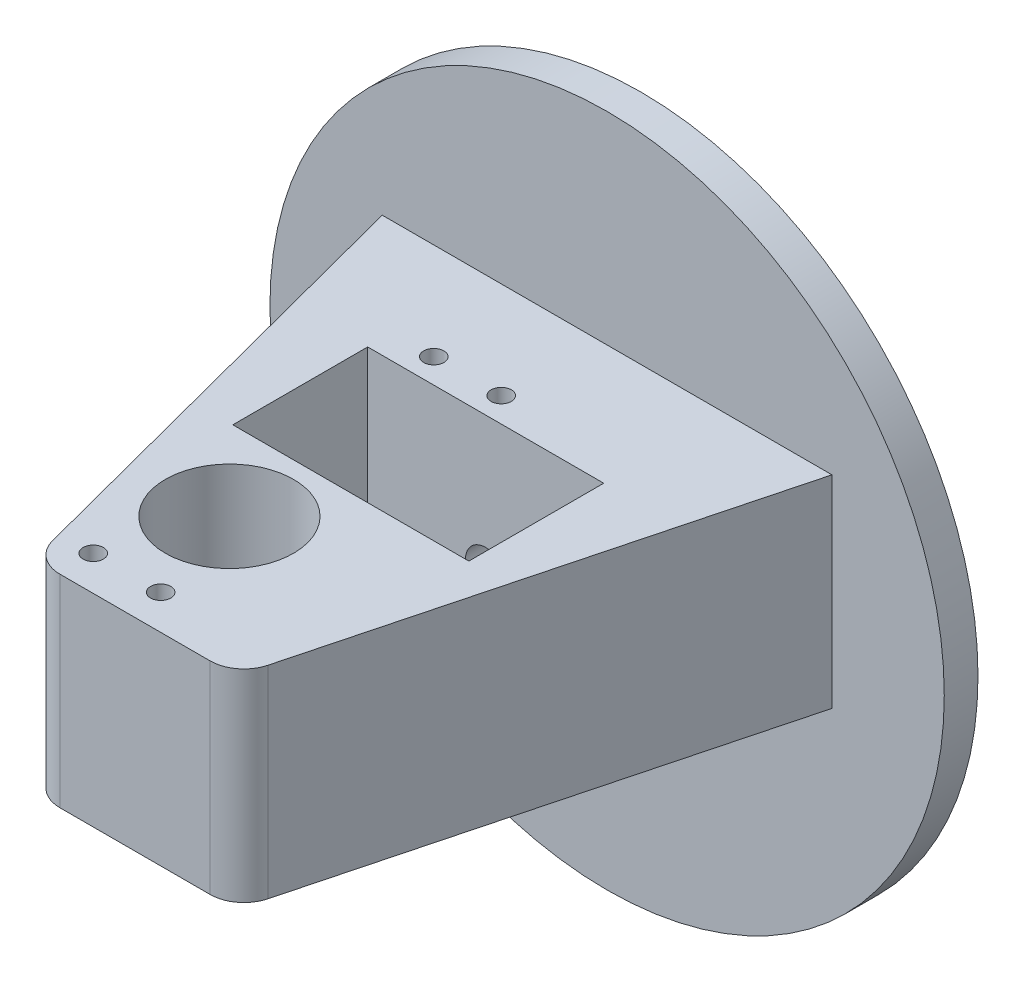
ISO-10303-21;
HEADER;
FILE_DESCRIPTION(('STEP AP214'),'2;1');
FILE_NAME('part.step','',(''),(''),'','','');
FILE_SCHEMA(('AUTOMOTIVE_DESIGN { 1 0 10303 214 1 1 1 1 }'));
ENDSEC;
DATA;
#1=APPLICATION_CONTEXT('core data for automotive mechanical design processes');
#2=APPLICATION_PROTOCOL_DEFINITION('international standard','automotive_design',2000,#1);
#3=PRODUCT_CONTEXT('',#1,'mechanical');
#4=PRODUCT('Part','Part','',(#3));
#5=PRODUCT_RELATED_PRODUCT_CATEGORY('part','',(#4));
#6=PRODUCT_DEFINITION_FORMATION('','',#4);
#7=PRODUCT_DEFINITION_CONTEXT('part definition',#1,'design');
#8=PRODUCT_DEFINITION('design','',#6,#7);
#9=PRODUCT_DEFINITION_SHAPE('','',#8);
#10=(LENGTH_UNIT() NAMED_UNIT(*) SI_UNIT(.MILLI.,.METRE.));
#11=(NAMED_UNIT(*) PLANE_ANGLE_UNIT() SI_UNIT($,.RADIAN.));
#12=(NAMED_UNIT(*) SI_UNIT($,.STERADIAN.) SOLID_ANGLE_UNIT());
#13=UNCERTAINTY_MEASURE_WITH_UNIT(LENGTH_MEASURE(1.E-05),#10,'distance_accuracy_value','');
#14=(GEOMETRIC_REPRESENTATION_CONTEXT(3) GLOBAL_UNCERTAINTY_ASSIGNED_CONTEXT((#13)) GLOBAL_UNIT_ASSIGNED_CONTEXT((#10,
#11,#12)) REPRESENTATION_CONTEXT('',''));
#15=CARTESIAN_POINT('',(0.,0.,0.));
#16=DIRECTION('',(0.,0.,1.));
#17=DIRECTION('',(1.,0.,0.));
#18=AXIS2_PLACEMENT_3D('',#15,#16,#17);
#19=CARTESIAN_POINT('',(-5.99999999999999,-20.000000000025,54.9999999999909));
#20=DIRECTION('',(0.,1.,4.54303261676614E-13));
#21=DIRECTION('',(0.,-4.54303261676614E-13,1.));
#22=AXIS2_PLACEMENT_3D('',#19,#20,#21);
#23=CYLINDRICAL_SURFACE('',#22,5.);
#24=CARTESIAN_POINT('',(-5.99999999999999,-2.49869569479699E-11,55.));
#25=DIRECTION('',(0.,1.,4.54303261676614E-13));
#26=DIRECTION('',(0.,-4.54303261676614E-13,1.));
#27=AXIS2_PLACEMENT_3D('',#24,#25,#26);
#28=CIRCLE('',#27,5.);
#29=CARTESIAN_POINT('',(-5.99999999999999,-2.7258473256353E-11,60.));
#30=VERTEX_POINT('',#29);
#31=EDGE_CURVE('E148',#30,#30,#28,.T.);
#32=ORIENTED_EDGE('',*,*,#31,.T.);
#33=EDGE_LOOP('',(#32));
#34=FACE_BOUND('',#33,.T.);
#35=CARTESIAN_POINT('',(-5.99999999999999,-4.00000000002499,54.9999999999982));
#36=DIRECTION('',(0.,-1.,-4.54303261676614E-13));
#37=DIRECTION('',(0.,4.54303261676614E-13,-1.));
#38=AXIS2_PLACEMENT_3D('',#35,#36,#37);
#39=CIRCLE('',#38,5.);
#40=CARTESIAN_POINT('',(-5.99999999999999,-4.00000000002272,49.9999999999982));
#41=VERTEX_POINT('',#40);
#42=EDGE_CURVE('E146',#41,#41,#39,.F.);
#43=ORIENTED_EDGE('',*,*,#42,.F.);
#44=EDGE_LOOP('',(#43));
#45=FACE_BOUND('',#44,.T.);
#46=ADVANCED_FACE('F38',(#34,#45),#23,.F.);
#47=CARTESIAN_POINT('',(-11.141347684202,-20.0000000000318,69.9999999999909));
#48=DIRECTION('',(0.,1.,4.54303261676614E-13));
#49=DIRECTION('',(0.,-4.54303261676614E-13,1.));
#50=AXIS2_PLACEMENT_3D('',#47,#48,#49);
#51=CYLINDRICAL_SURFACE('',#50,5.);
#52=DIRECTION('',(0.,1.,4.54303261676614E-13));
#53=VECTOR('',#52,1.);
#54=CARTESIAN_POINT('',(-15.978061053794,-20.0000000000324,71.2673609511055));
#55=LINE('',#54,#53);
#56=CARTESIAN_POINT('',(-15.978061053794,-10.0000000000324,71.26736095111));
#57=VERTEX_POINT('',#56);
#58=CARTESIAN_POINT('',(-15.978061053794,19.9999999999676,71.2673609511237));
#59=VERTEX_POINT('',#58);
#60=EDGE_CURVE('E11',#57,#59,#55,.T.);
#61=ORIENTED_EDGE('',*,*,#60,.F.);
#62=CARTESIAN_POINT('',(-11.141347684202,-10.0000000000318,69.9999999999955));
#63=DIRECTION('',(0.,1.,4.54303261676614E-13));
#64=DIRECTION('',(0.,-4.54303261676614E-13,1.));
#65=AXIS2_PLACEMENT_3D('',#62,#63,#64);
#66=CIRCLE('',#65,5.);
#67=CARTESIAN_POINT('',(-11.141347684202,-10.0000000000341,74.9999999999955));
#68=VERTEX_POINT('',#67);
#69=EDGE_CURVE('E122',#57,#68,#66,.T.);
#70=ORIENTED_EDGE('',*,*,#69,.T.);
#71=DIRECTION('',(0.,1.,4.54303261676614E-13));
#72=VECTOR('',#71,1.);
#73=CARTESIAN_POINT('',(-11.141347684202,-20.0000000000341,74.9999999999909));
#74=LINE('',#73,#72);
#75=CARTESIAN_POINT('',(-11.141347684202,19.9999999999659,75.0000000000091));
#76=VERTEX_POINT('',#75);
#77=EDGE_CURVE('E187',#68,#76,#74,.T.);
#78=ORIENTED_EDGE('',*,*,#77,.T.);
#79=CARTESIAN_POINT('',(-11.141347684202,19.9999999999682,70.0000000000091));
#80=DIRECTION('',(0.,-1.,-4.54303261676614E-13));
#81=DIRECTION('',(0.,4.54303261676614E-13,-1.));
#82=AXIS2_PLACEMENT_3D('',#79,#80,#81);
#83=CIRCLE('',#82,5.);
#84=EDGE_CURVE('E170',#76,#59,#83,.T.);
#85=ORIENTED_EDGE('',*,*,#84,.T.);
#86=EDGE_LOOP('',(#61,#70,#78,#85));
#87=FACE_BOUND('',#86,.T.);
#88=ADVANCED_FACE('F40',(#87),#51,.T.);
#89=CARTESIAN_POINT('',(-33.3420558133058,-20.0000000000023,4.99999999999093));
#90=DIRECTION('',(0.9673426739184,1.15153242762584E-13,-0.253472190222911));
#91=DIRECTION('',(0.253472190222911,-4.39466931920107E-13,0.9673426739184));
#92=AXIS2_PLACEMENT_3D('',#89,#90,#91);
#93=PLANE('',#92);
#94=DIRECTION('',(0.,1.,4.54303261676614E-13));
#95=VECTOR('',#94,1.);
#96=CARTESIAN_POINT('',(-33.3420558133058,-20.0000000000023,4.99999999999093));
#97=LINE('',#96,#95);
#98=CARTESIAN_POINT('',(-33.3420558133058,-10.0000000000023,4.99999999999547));
#99=VERTEX_POINT('',#98);
#100=CARTESIAN_POINT('',(-33.3420558133058,19.9999999999977,5.00000000000909));
#101=VERTEX_POINT('',#100);
#102=EDGE_CURVE('E47',#99,#101,#97,.T.);
#103=ORIENTED_EDGE('',*,*,#102,.F.);
#104=DIRECTION('',(0.253472190222911,-4.39466931920107E-13,0.9673426739184));
#105=VECTOR('',#104,1.);
#106=CARTESIAN_POINT('',(-33.3420558133058,-10.0000000000023,4.99999999999547));
#107=LINE('',#106,#105);
#108=EDGE_CURVE('E116',#99,#57,#107,.T.);
#109=ORIENTED_EDGE('',*,*,#108,.T.);
#110=ORIENTED_EDGE('',*,*,#60,.T.);
#111=DIRECTION('',(-0.253472190222911,4.39466931920107E-13,-0.9673426739184));
#112=VECTOR('',#111,1.);
#113=CARTESIAN_POINT('',(-33.3420558133058,19.9999999999977,5.00000000000909));
#114=LINE('',#113,#112);
#115=EDGE_CURVE('E141',#59,#101,#114,.T.);
#116=ORIENTED_EDGE('',*,*,#115,.T.);
#117=EDGE_LOOP('',(#103,#109,#110,#116));
#118=FACE_BOUND('',#117,.T.);
#119=ADVANCED_FACE('F139',(#118),#93,.F.);
#120=CARTESIAN_POINT('',(15.978061053794,-20.0000000000324,71.2673609511055));
#121=DIRECTION('',(-0.9673426739184,1.15153242762584E-13,-0.253472190222912));
#122=DIRECTION('',(0.253472190222911,4.39466931920106E-13,-0.9673426739184));
#123=AXIS2_PLACEMENT_3D('',#120,#121,#122);
#124=PLANE('',#123);
#125=DIRECTION('',(0.,1.,4.54303261676614E-13));
#126=VECTOR('',#125,1.);
#127=CARTESIAN_POINT('',(15.978061053794,-20.0000000000324,71.2673609511055));
#128=LINE('',#127,#126);
#129=CARTESIAN_POINT('',(15.978061053794,-10.0000000000324,71.26736095111));
#130=VERTEX_POINT('',#129);
#131=CARTESIAN_POINT('',(15.978061053794,19.9999999999676,71.2673609511237));
#132=VERTEX_POINT('',#131);
#133=EDGE_CURVE('E143',#130,#132,#128,.T.);
#134=ORIENTED_EDGE('',*,*,#133,.F.);
#135=DIRECTION('',(0.253472190222911,4.39466931920106E-13,-0.9673426739184));
#136=VECTOR('',#135,1.);
#137=CARTESIAN_POINT('',(15.978061053794,-10.0000000000324,71.26736095111));
#138=LINE('',#137,#136);
#139=CARTESIAN_POINT('',(33.3420558133058,-10.0000000000023,4.99999999999547));
#140=VERTEX_POINT('',#139);
#141=EDGE_CURVE('E211',#130,#140,#138,.T.);
#142=ORIENTED_EDGE('',*,*,#141,.T.);
#143=DIRECTION('',(0.,1.,4.54303261676614E-13));
#144=VECTOR('',#143,1.);
#145=CARTESIAN_POINT('',(33.3420558133058,-20.0000000000023,4.99999999999093));
#146=LINE('',#145,#144);
#147=CARTESIAN_POINT('',(33.3420558133058,19.9999999999977,5.00000000000909));
#148=VERTEX_POINT('',#147);
#149=EDGE_CURVE('E134',#140,#148,#146,.T.);
#150=ORIENTED_EDGE('',*,*,#149,.T.);
#151=DIRECTION('',(-0.253472190222911,-4.39466931920106E-13,0.9673426739184));
#152=VECTOR('',#151,1.);
#153=CARTESIAN_POINT('',(15.978061053794,19.9999999999676,71.2673609511237));
#154=LINE('',#153,#152);
#155=EDGE_CURVE('E178',#148,#132,#154,.T.);
#156=ORIENTED_EDGE('',*,*,#155,.T.);
#157=EDGE_LOOP('',(#134,#142,#150,#156));
#158=FACE_BOUND('',#157,.T.);
#159=ADVANCED_FACE('F200',(#158),#124,.F.);
#160=CARTESIAN_POINT('',(11.141347684202,-20.0000000000318,69.9999999999909));
#161=DIRECTION('',(0.,1.,4.54303261676614E-13));
#162=DIRECTION('',(0.,-4.54303261676614E-13,1.));
#163=AXIS2_PLACEMENT_3D('',#160,#161,#162);
#164=CYLINDRICAL_SURFACE('',#163,5.);
#165=DIRECTION('',(0.,1.,4.54303261676614E-13));
#166=VECTOR('',#165,1.);
#167=CARTESIAN_POINT('',(11.141347684202,-20.0000000000341,74.9999999999909));
#168=LINE('',#167,#166);
#169=CARTESIAN_POINT('',(11.141347684202,-10.0000000000341,74.9999999999955));
#170=VERTEX_POINT('',#169);
#171=CARTESIAN_POINT('',(11.141347684202,19.9999999999659,75.0000000000091));
#172=VERTEX_POINT('',#171);
#173=EDGE_CURVE('E189',#170,#172,#168,.T.);
#174=ORIENTED_EDGE('',*,*,#173,.F.);
#175=CARTESIAN_POINT('',(11.141347684202,-10.0000000000318,69.9999999999955));
#176=DIRECTION('',(0.,1.,4.54303261676614E-13));
#177=DIRECTION('',(0.,-4.54303261676614E-13,1.));
#178=AXIS2_PLACEMENT_3D('',#175,#176,#177);
#179=CIRCLE('',#178,5.);
#180=EDGE_CURVE('E197',#170,#130,#179,.T.);
#181=ORIENTED_EDGE('',*,*,#180,.T.);
#182=ORIENTED_EDGE('',*,*,#133,.T.);
#183=CARTESIAN_POINT('',(11.141347684202,19.9999999999682,70.0000000000091));
#184=DIRECTION('',(0.,-1.,-4.54303261676614E-13));
#185=DIRECTION('',(0.,-4.54303261676614E-13,1.));
#186=AXIS2_PLACEMENT_3D('',#183,#184,#185);
#187=CIRCLE('',#186,5.);
#188=EDGE_CURVE('E181',#132,#172,#187,.T.);
#189=ORIENTED_EDGE('',*,*,#188,.T.);
#190=EDGE_LOOP('',(#174,#181,#182,#189));
#191=FACE_BOUND('',#190,.T.);
#192=ADVANCED_FACE('F194',(#191),#164,.T.);
#193=CARTESIAN_POINT('',(-11.141347684202,-20.0000000000341,74.9999999999909));
#194=DIRECTION('',(0.,4.54303261676614E-13,-1.));
#195=DIRECTION('',(1.,0.,0.));
#196=AXIS2_PLACEMENT_3D('',#193,#194,#195);
#197=PLANE('',#196);
#198=ORIENTED_EDGE('',*,*,#77,.F.);
#199=DIRECTION('',(1.,0.,0.));
#200=VECTOR('',#199,1.);
#201=CARTESIAN_POINT('',(-11.141347684202,-10.0000000000341,74.9999999999955));
#202=LINE('',#201,#200);
#203=EDGE_CURVE('E208',#68,#170,#202,.T.);
#204=ORIENTED_EDGE('',*,*,#203,.T.);
#205=ORIENTED_EDGE('',*,*,#173,.T.);
#206=DIRECTION('',(-1.,0.,0.));
#207=VECTOR('',#206,1.);
#208=CARTESIAN_POINT('',(-11.141347684202,19.9999999999659,75.0000000000091));
#209=LINE('',#208,#207);
#210=EDGE_CURVE('E184',#172,#76,#209,.T.);
#211=ORIENTED_EDGE('',*,*,#210,.T.);
#212=EDGE_LOOP('',(#198,#204,#205,#211));
#213=FACE_BOUND('',#212,.T.);
#214=ADVANCED_FACE('F206',(#213),#197,.F.);
#215=CARTESIAN_POINT('',(-11.141347684202,19.9999999999682,70.0000000000091));
#216=DIRECTION('',(0.,-1.,-4.54303261676614E-13));
#217=DIRECTION('',(0.,4.54303261676614E-13,-1.));
#218=AXIS2_PLACEMENT_3D('',#215,#216,#217);
#219=PLANE('',#218);
#220=CARTESIAN_POINT('',(-11.3501899868682,19.9999999999912,19.3500000000087));
#221=DIRECTION('',(0.,1.,4.54303261676614E-13));
#222=DIRECTION('',(0.,-4.54303261676614E-13,1.));
#223=AXIS2_PLACEMENT_3D('',#220,#221,#222);
#224=CIRCLE('',#223,1.50000000000009);
#225=CARTESIAN_POINT('',(-11.3501899868682,19.9999999999905,20.8500000000087));
#226=VERTEX_POINT('',#225);
#227=EDGE_CURVE('E272',#226,#226,#224,.T.);
#228=ORIENTED_EDGE('',*,*,#227,.F.);
#229=EDGE_LOOP('',(#228));
#230=FACE_BOUND('',#229,.T.);
#231=CARTESIAN_POINT('',(-1.35018998686818,19.9999999999912,19.3500000000087));
#232=DIRECTION('',(0.,1.,4.54303261676614E-13));
#233=DIRECTION('',(0.,-4.54303261676614E-13,1.));
#234=AXIS2_PLACEMENT_3D('',#231,#232,#233);
#235=CIRCLE('',#234,1.5000000000001);
#236=CARTESIAN_POINT('',(-1.35018998686818,19.9999999999905,20.8500000000088));
#237=VERTEX_POINT('',#236);
#238=EDGE_CURVE('E266',#237,#237,#235,.T.);
#239=ORIENTED_EDGE('',*,*,#238,.F.);
#240=EDGE_LOOP('',(#239));
#241=FACE_BOUND('',#240,.T.);
#242=CARTESIAN_POINT('',(-1.35018998686803,19.9999999999683,69.8500000000089));
#243=DIRECTION('',(0.,1.,4.54303261676614E-13));
#244=DIRECTION('',(0.,-4.54303261676614E-13,1.));
#245=AXIS2_PLACEMENT_3D('',#242,#243,#244);
#246=CIRCLE('',#245,1.5);
#247=CARTESIAN_POINT('',(-1.35018998686803,19.9999999999676,71.3500000000089));
#248=VERTEX_POINT('',#247);
#249=EDGE_CURVE('E261',#248,#248,#246,.T.);
#250=ORIENTED_EDGE('',*,*,#249,.F.);
#251=EDGE_LOOP('',(#250));
#252=FACE_BOUND('',#251,.T.);
#253=CARTESIAN_POINT('',(-11.350189986868,19.9999999999683,69.8500000000089));
#254=DIRECTION('',(0.,1.,4.54303261676614E-13));
#255=DIRECTION('',(0.,-4.54303261676614E-13,1.));
#256=AXIS2_PLACEMENT_3D('',#253,#254,#255);
#257=CIRCLE('',#256,1.5);
#258=CARTESIAN_POINT('',(-11.350189986868,19.9999999999676,71.3500000000089));
#259=VERTEX_POINT('',#258);
#260=EDGE_CURVE('E254',#259,#259,#257,.T.);
#261=ORIENTED_EDGE('',*,*,#260,.F.);
#262=EDGE_LOOP('',(#261));
#263=FACE_BOUND('',#262,.T.);
#264=DIRECTION('',(1.,0.,0.));
#265=VECTOR('',#264,1.);
#266=CARTESIAN_POINT('',(-17.5,19.9999999999896,23.0000000000091));
#267=LINE('',#266,#265);
#268=CARTESIAN_POINT('',(-17.5,19.9999999999896,23.0000000000091));
#269=VERTEX_POINT('',#268);
#270=CARTESIAN_POINT('',(17.5,19.9999999999896,23.0000000000091));
#271=VERTEX_POINT('',#270);
#272=EDGE_CURVE('E235',#269,#271,#267,.T.);
#273=ORIENTED_EDGE('',*,*,#272,.T.);
#274=DIRECTION('',(0.,-4.54303261676614E-13,1.));
#275=VECTOR('',#274,1.);
#276=CARTESIAN_POINT('',(17.5,19.9999999999896,23.0000000000091));
#277=LINE('',#276,#275);
#278=CARTESIAN_POINT('',(17.5,19.9999999999805,43.0000000000091));
#279=VERTEX_POINT('',#278);
#280=EDGE_CURVE('E228',#271,#279,#277,.T.);
#281=ORIENTED_EDGE('',*,*,#280,.T.);
#282=DIRECTION('',(-1.,0.,0.));
#283=VECTOR('',#282,1.);
#284=CARTESIAN_POINT('',(-17.5,19.9999999999805,43.0000000000091));
#285=LINE('',#284,#283);
#286=CARTESIAN_POINT('',(-17.5,19.9999999999805,43.0000000000091));
#287=VERTEX_POINT('',#286);
#288=EDGE_CURVE('E231',#279,#287,#285,.T.);
#289=ORIENTED_EDGE('',*,*,#288,.T.);
#290=DIRECTION('',(0.,4.54303261676614E-13,-1.));
#291=VECTOR('',#290,1.);
#292=CARTESIAN_POINT('',(-17.5,19.9999999999896,23.0000000000091));
#293=LINE('',#292,#291);
#294=EDGE_CURVE('E63',#287,#269,#293,.T.);
#295=ORIENTED_EDGE('',*,*,#294,.T.);
#296=EDGE_LOOP('',(#273,#281,#289,#295));
#297=FACE_BOUND('',#296,.T.);
#298=CARTESIAN_POINT('',(-5.99999999999999,19.999999999975,55.0000000000091));
#299=DIRECTION('',(0.,1.,4.54303261676614E-13));
#300=DIRECTION('',(0.,-4.54303261676614E-13,1.));
#301=AXIS2_PLACEMENT_3D('',#298,#299,#300);
#302=CIRCLE('',#301,9.5);
#303=CARTESIAN_POINT('',(-5.99999999999999,19.9999999999707,64.5000000000091));
#304=VERTEX_POINT('',#303);
#305=EDGE_CURVE('E153',#304,#304,#302,.T.);
#306=ORIENTED_EDGE('',*,*,#305,.F.);
#307=EDGE_LOOP('',(#306));
#308=FACE_BOUND('',#307,.T.);
#309=ORIENTED_EDGE('',*,*,#84,.F.);
#310=ORIENTED_EDGE('',*,*,#210,.F.);
#311=ORIENTED_EDGE('',*,*,#188,.F.);
#312=ORIENTED_EDGE('',*,*,#155,.F.);
#313=DIRECTION('',(1.,0.,0.));
#314=VECTOR('',#313,1.);
#315=CARTESIAN_POINT('',(33.3420558133058,19.9999999999977,5.00000000000909));
#316=LINE('',#315,#314);
#317=EDGE_CURVE('E176',#101,#148,#316,.T.);
#318=ORIENTED_EDGE('',*,*,#317,.F.);
#319=ORIENTED_EDGE('',*,*,#115,.F.);
#320=EDGE_LOOP('',(#309,#310,#311,#312,#318,#319));
#321=FACE_BOUND('',#320,.T.);
#322=ADVANCED_FACE('F203',(#230,#241,#252,#263,#297,#308,#321),#219,.F.);
#323=CARTESIAN_POINT('',(-5.99999999999999,-2.49869569479699E-11,55.));
#324=DIRECTION('',(0.,1.,4.54303261676614E-13));
#325=DIRECTION('',(0.,-4.54303261676614E-13,1.));
#326=AXIS2_PLACEMENT_3D('',#323,#324,#325);
#327=CYLINDRICAL_SURFACE('',#326,9.5);
#328=CARTESIAN_POINT('',(-5.99999999999999,-2.49869569479699E-11,55.));
#329=DIRECTION('',(0.,1.,4.54303261676614E-13));
#330=DIRECTION('',(0.,-4.54303261676614E-13,1.));
#331=AXIS2_PLACEMENT_3D('',#328,#329,#330);
#332=CIRCLE('',#331,9.5);
#333=CARTESIAN_POINT('',(-5.99999999999999,-2.93028379338978E-11,64.5));
#334=VERTEX_POINT('',#333);
#335=EDGE_CURVE('E167',#334,#334,#332,.T.);
#336=ORIENTED_EDGE('',*,*,#335,.F.);
#337=EDGE_LOOP('',(#336));
#338=FACE_BOUND('',#337,.T.);
#339=ORIENTED_EDGE('',*,*,#305,.T.);
#340=EDGE_LOOP('',(#339));
#341=FACE_BOUND('',#340,.T.);
#342=ADVANCED_FACE('F289',(#338,#341),#327,.F.);
#343=CARTESIAN_POINT('',(-5.99999999999999,-2.49869569479699E-11,55.));
#344=DIRECTION('',(0.,1.,4.54303261676614E-13));
#345=DIRECTION('',(0.,-4.54303261676614E-13,1.));
#346=AXIS2_PLACEMENT_3D('',#343,#344,#345);
#347=PLANE('',#346);
#348=ORIENTED_EDGE('',*,*,#31,.F.);
#349=EDGE_LOOP('',(#348));
#350=FACE_BOUND('',#349,.T.);
#351=ORIENTED_EDGE('',*,*,#335,.T.);
#352=EDGE_LOOP('',(#351));
#353=FACE_BOUND('',#352,.T.);
#354=ADVANCED_FACE('F302',(#350,#353),#347,.T.);
#355=CARTESIAN_POINT('',(-5.99999999999999,-4.00000000002499,54.9999999999982));
#356=DIRECTION('',(0.,-1.,-4.54303261676614E-13));
#357=DIRECTION('',(0.,4.54303261676614E-13,-1.));
#358=AXIS2_PLACEMENT_3D('',#355,#356,#357);
#359=PLANE('',#358);
#360=CARTESIAN_POINT('',(-5.99999999999999,-4.00000000002499,54.9999999999982));
#361=DIRECTION('',(0.,-1.,-4.54303261676614E-13));
#362=DIRECTION('',(0.,4.54303261676614E-13,-1.));
#363=AXIS2_PLACEMENT_3D('',#360,#361,#362);
#364=CIRCLE('',#363,9.5);
#365=CARTESIAN_POINT('',(-5.99999999999999,-4.00000000002067,45.4999999999982));
#366=VERTEX_POINT('',#365);
#367=EDGE_CURVE('E149',#366,#366,#364,.T.);
#368=ORIENTED_EDGE('',*,*,#367,.T.);
#369=EDGE_LOOP('',(#368));
#370=FACE_BOUND('',#369,.T.);
#371=ORIENTED_EDGE('',*,*,#42,.T.);
#372=EDGE_LOOP('',(#371));
#373=FACE_BOUND('',#372,.T.);
#374=ADVANCED_FACE('F308',(#370,#373),#359,.T.);
#375=CARTESIAN_POINT('',(-5.99999999999999,-4.00000000002499,54.9999999999982));
#376=DIRECTION('',(0.,-1.,-4.54303261676614E-13));
#377=DIRECTION('',(0.,4.54303261676614E-13,-1.));
#378=AXIS2_PLACEMENT_3D('',#375,#376,#377);
#379=CYLINDRICAL_SURFACE('',#378,9.5);
#380=CARTESIAN_POINT('',(-5.99999999999999,-10.000000000025,54.9999999999955));
#381=DIRECTION('',(0.,1.,4.54303261676614E-13));
#382=DIRECTION('',(0.,-4.54303261676614E-13,1.));
#383=AXIS2_PLACEMENT_3D('',#380,#381,#382);
#384=CIRCLE('',#383,9.5);
#385=CARTESIAN_POINT('',(-5.99999999999999,-10.0000000000293,64.4999999999955));
#386=VERTEX_POINT('',#385);
#387=EDGE_CURVE('E209',#386,#386,#384,.F.);
#388=ORIENTED_EDGE('',*,*,#387,.T.);
#389=EDGE_LOOP('',(#388));
#390=FACE_BOUND('',#389,.T.);
#391=ORIENTED_EDGE('',*,*,#367,.F.);
#392=EDGE_LOOP('',(#391));
#393=FACE_BOUND('',#392,.T.);
#394=ADVANCED_FACE('F321',(#390,#393),#379,.F.);
#395=CARTESIAN_POINT('',(17.5,19.9999999999896,23.0000000000091));
#396=DIRECTION('',(1.,0.,0.));
#397=DIRECTION('',(0.,-4.54303261676614E-13,1.));
#398=AXIS2_PLACEMENT_3D('',#395,#396,#397);
#399=PLANE('',#398);
#400=DIRECTION('',(0.,-1.,-4.54303261676614E-13));
#401=VECTOR('',#400,1.);
#402=CARTESIAN_POINT('',(17.5,19.9999999999896,23.0000000000091));
#403=LINE('',#402,#401);
#404=CARTESIAN_POINT('',(17.5,-10.0000000000105,22.9999999999955));
#405=VERTEX_POINT('',#404);
#406=EDGE_CURVE('E156',#271,#405,#403,.T.);
#407=ORIENTED_EDGE('',*,*,#406,.T.);
#408=DIRECTION('',(0.,-4.54303261676614E-13,1.));
#409=VECTOR('',#408,1.);
#410=CARTESIAN_POINT('',(17.5,-10.0000000000105,22.9999999999955));
#411=LINE('',#410,#409);
#412=CARTESIAN_POINT('',(17.5,-10.0000000000195,42.9999999999955));
#413=VERTEX_POINT('',#412);
#414=EDGE_CURVE('E214',#405,#413,#411,.T.);
#415=ORIENTED_EDGE('',*,*,#414,.T.);
#416=DIRECTION('',(0.,-1.,-4.54303261676614E-13));
#417=VECTOR('',#416,1.);
#418=CARTESIAN_POINT('',(17.5,19.9999999999805,43.0000000000091));
#419=LINE('',#418,#417);
#420=EDGE_CURVE('E164',#279,#413,#419,.T.);
#421=ORIENTED_EDGE('',*,*,#420,.F.);
#422=ORIENTED_EDGE('',*,*,#280,.F.);
#423=EDGE_LOOP('',(#407,#415,#421,#422));
#424=FACE_BOUND('',#423,.T.);
#425=ADVANCED_FACE('F247',(#424),#399,.F.);
#426=CARTESIAN_POINT('',(-17.5,19.9999999999896,23.0000000000091));
#427=DIRECTION('',(0.,4.54303261676614E-13,-1.));
#428=DIRECTION('',(1.,0.,0.));
#429=AXIS2_PLACEMENT_3D('',#426,#427,#428);
#430=PLANE('',#429);
#431=CARTESIAN_POINT('',(0.,-1.04499742192843E-11,23.));
#432=DIRECTION('',(0.,4.54303261676614E-13,-1.));
#433=DIRECTION('',(1.,0.,0.));
#434=AXIS2_PLACEMENT_3D('',#431,#432,#433);
#435=CIRCLE('',#434,3.);
#436=CARTESIAN_POINT('',(3.,-1.04499742192843E-11,23.));
#437=VERTEX_POINT('',#436);
#438=EDGE_CURVE('E42',#437,#437,#435,.T.);
#439=ORIENTED_EDGE('',*,*,#438,.T.);
#440=EDGE_LOOP('',(#439));
#441=FACE_BOUND('',#440,.T.);
#442=DIRECTION('',(0.,-1.,-4.54303261676614E-13));
#443=VECTOR('',#442,1.);
#444=CARTESIAN_POINT('',(-17.5,19.9999999999896,23.0000000000091));
#445=LINE('',#444,#443);
#446=CARTESIAN_POINT('',(-17.5,-10.0000000000105,22.9999999999955));
#447=VERTEX_POINT('',#446);
#448=EDGE_CURVE('E161',#269,#447,#445,.T.);
#449=ORIENTED_EDGE('',*,*,#448,.T.);
#450=DIRECTION('',(1.,0.,0.));
#451=VECTOR('',#450,1.);
#452=CARTESIAN_POINT('',(-17.5,-10.0000000000105,22.9999999999955));
#453=LINE('',#452,#451);
#454=EDGE_CURVE('E249',#447,#405,#453,.T.);
#455=ORIENTED_EDGE('',*,*,#454,.T.);
#456=ORIENTED_EDGE('',*,*,#406,.F.);
#457=ORIENTED_EDGE('',*,*,#272,.F.);
#458=EDGE_LOOP('',(#449,#455,#456,#457));
#459=FACE_BOUND('',#458,.T.);
#460=ADVANCED_FACE('F329',(#441,#459),#430,.F.);
#461=CARTESIAN_POINT('',(-17.5,19.9999999999896,23.0000000000091));
#462=DIRECTION('',(-1.,0.,0.));
#463=DIRECTION('',(0.,4.54303261676614E-13,-1.));
#464=AXIS2_PLACEMENT_3D('',#461,#462,#463);
#465=PLANE('',#464);
#466=DIRECTION('',(0.,-1.,-4.54303261676614E-13));
#467=VECTOR('',#466,1.);
#468=CARTESIAN_POINT('',(-17.5,19.9999999999805,43.0000000000091));
#469=LINE('',#468,#467);
#470=CARTESIAN_POINT('',(-17.5,-10.0000000000195,42.9999999999955));
#471=VERTEX_POINT('',#470);
#472=EDGE_CURVE('E239',#287,#471,#469,.T.);
#473=ORIENTED_EDGE('',*,*,#472,.T.);
#474=DIRECTION('',(0.,4.54303261676614E-13,-1.));
#475=VECTOR('',#474,1.);
#476=CARTESIAN_POINT('',(-17.5,-10.0000000000105,22.9999999999955));
#477=LINE('',#476,#475);
#478=EDGE_CURVE('E55',#471,#447,#477,.T.);
#479=ORIENTED_EDGE('',*,*,#478,.T.);
#480=ORIENTED_EDGE('',*,*,#448,.F.);
#481=ORIENTED_EDGE('',*,*,#294,.F.);
#482=EDGE_LOOP('',(#473,#479,#480,#481));
#483=FACE_BOUND('',#482,.T.);
#484=ADVANCED_FACE('F333',(#483),#465,.F.);
#485=CARTESIAN_POINT('',(-17.5,19.9999999999805,43.0000000000091));
#486=DIRECTION('',(0.,-4.54303261676614E-13,1.));
#487=DIRECTION('',(-1.,0.,0.));
#488=AXIS2_PLACEMENT_3D('',#485,#486,#487);
#489=PLANE('',#488);
#490=ORIENTED_EDGE('',*,*,#420,.T.);
#491=DIRECTION('',(-1.,0.,0.));
#492=VECTOR('',#491,1.);
#493=CARTESIAN_POINT('',(-17.5,-10.0000000000195,42.9999999999955));
#494=LINE('',#493,#492);
#495=EDGE_CURVE('E135',#413,#471,#494,.T.);
#496=ORIENTED_EDGE('',*,*,#495,.T.);
#497=ORIENTED_EDGE('',*,*,#472,.F.);
#498=ORIENTED_EDGE('',*,*,#288,.F.);
#499=EDGE_LOOP('',(#490,#496,#497,#498));
#500=FACE_BOUND('',#499,.T.);
#501=ADVANCED_FACE('F243',(#500),#489,.F.);
#502=CARTESIAN_POINT('',(0.,-1.36314570742258E-11,30.));
#503=DIRECTION('',(0.,4.54303261676614E-13,-1.));
#504=DIRECTION('',(1.,0.,0.));
#505=AXIS2_PLACEMENT_3D('',#502,#503,#504);
#506=CYLINDRICAL_SURFACE('',#505,3.);
#507=ORIENTED_EDGE('',*,*,#438,.F.);
#508=EDGE_LOOP('',(#507));
#509=FACE_BOUND('',#508,.T.);
#510=CARTESIAN_POINT('',(0.,0.,0.));
#511=DIRECTION('',(0.,4.54303261676614E-13,-1.));
#512=DIRECTION('',(1.,0.,0.));
#513=AXIS2_PLACEMENT_3D('',#510,#511,#512);
#514=CIRCLE('',#513,3.);
#515=CARTESIAN_POINT('',(3.,0.,0.));
#516=VERTEX_POINT('',#515);
#517=EDGE_CURVE('E126',#516,#516,#514,.T.);
#518=ORIENTED_EDGE('',*,*,#517,.T.);
#519=EDGE_LOOP('',(#518));
#520=FACE_BOUND('',#519,.T.);
#521=ADVANCED_FACE('F332',(#509,#520),#506,.F.);
#522=CARTESIAN_POINT('',(0.,-2.27248775352962E-12,5.));
#523=DIRECTION('',(0.,4.54303261676614E-13,-1.));
#524=DIRECTION('',(1.,0.,0.));
#525=AXIS2_PLACEMENT_3D('',#522,#523,#524);
#526=PLANE('',#525);
#527=ORIENTED_EDGE('',*,*,#149,.F.);
#528=DIRECTION('',(1.,0.,0.));
#529=VECTOR('',#528,1.);
#530=CARTESIAN_POINT('',(-33.3420558133058,-10.0000000000023,4.99999999999547));
#531=LINE('',#530,#529);
#532=EDGE_CURVE('E119',#99,#140,#531,.T.);
#533=ORIENTED_EDGE('',*,*,#532,.F.);
#534=ORIENTED_EDGE('',*,*,#102,.T.);
#535=ORIENTED_EDGE('',*,*,#317,.T.);
#536=EDGE_LOOP('',(#527,#533,#534,#535));
#537=FACE_BOUND('',#536,.T.);
#538=CARTESIAN_POINT('',(0.,-2.27248775352962E-12,5.));
#539=DIRECTION('',(0.,4.54303261676614E-13,-1.));
#540=DIRECTION('',(1.,0.,0.));
#541=AXIS2_PLACEMENT_3D('',#538,#539,#540);
#542=CIRCLE('',#541,50.);
#543=CARTESIAN_POINT('',(50.,-2.27248775352962E-12,5.));
#544=VERTEX_POINT('',#543);
#545=EDGE_CURVE('E222',#544,#544,#542,.T.);
#546=ORIENTED_EDGE('',*,*,#545,.F.);
#547=EDGE_LOOP('',(#546));
#548=FACE_BOUND('',#547,.T.);
#549=ADVANCED_FACE('F130',(#537,#548),#526,.F.);
#550=CARTESIAN_POINT('',(0.,0.,0.));
#551=DIRECTION('',(0.,4.54303261676614E-13,-1.));
#552=DIRECTION('',(1.,0.,0.));
#553=AXIS2_PLACEMENT_3D('',#550,#551,#552);
#554=PLANE('',#553);
#555=CARTESIAN_POINT('',(0.,0.,0.));
#556=DIRECTION('',(0.,4.54303261676614E-13,-1.));
#557=DIRECTION('',(1.,0.,0.));
#558=AXIS2_PLACEMENT_3D('',#555,#556,#557);
#559=CIRCLE('',#558,50.);
#560=CARTESIAN_POINT('',(50.,0.,0.));
#561=VERTEX_POINT('',#560);
#562=EDGE_CURVE('E223',#561,#561,#559,.T.);
#563=ORIENTED_EDGE('',*,*,#562,.T.);
#564=EDGE_LOOP('',(#563));
#565=FACE_BOUND('',#564,.T.);
#566=ORIENTED_EDGE('',*,*,#517,.F.);
#567=EDGE_LOOP('',(#566));
#568=FACE_BOUND('',#567,.T.);
#569=ADVANCED_FACE('F345',(#565,#568),#554,.T.);
#570=CARTESIAN_POINT('',(0.,0.,0.));
#571=DIRECTION('',(0.,-4.54303261676614E-13,1.));
#572=DIRECTION('',(-1.,0.,0.));
#573=AXIS2_PLACEMENT_3D('',#570,#571,#572);
#574=CYLINDRICAL_SURFACE('',#573,50.);
#575=ORIENTED_EDGE('',*,*,#562,.F.);
#576=EDGE_LOOP('',(#575));
#577=FACE_BOUND('',#576,.T.);
#578=ORIENTED_EDGE('',*,*,#545,.T.);
#579=EDGE_LOOP('',(#578));
#580=FACE_BOUND('',#579,.T.);
#581=ADVANCED_FACE('F342',(#577,#580),#574,.T.);
#582=CARTESIAN_POINT('',(0.,-10.0000000000023,4.99999999999547));
#583=DIRECTION('',(0.,1.,4.54303261676614E-13));
#584=DIRECTION('',(0.,-4.54303261676614E-13,1.));
#585=AXIS2_PLACEMENT_3D('',#582,#583,#584);
#586=PLANE('',#585);
#587=ORIENTED_EDGE('',*,*,#454,.F.);
#588=ORIENTED_EDGE('',*,*,#478,.F.);
#589=ORIENTED_EDGE('',*,*,#495,.F.);
#590=ORIENTED_EDGE('',*,*,#414,.F.);
#591=EDGE_LOOP('',(#587,#588,#589,#590));
#592=FACE_BOUND('',#591,.T.);
#593=ORIENTED_EDGE('',*,*,#387,.F.);
#594=EDGE_LOOP('',(#593));
#595=FACE_BOUND('',#594,.T.);
#596=ORIENTED_EDGE('',*,*,#532,.T.);
#597=ORIENTED_EDGE('',*,*,#141,.F.);
#598=ORIENTED_EDGE('',*,*,#180,.F.);
#599=ORIENTED_EDGE('',*,*,#203,.F.);
#600=ORIENTED_EDGE('',*,*,#69,.F.);
#601=ORIENTED_EDGE('',*,*,#108,.F.);
#602=EDGE_LOOP('',(#596,#597,#598,#599,#600,#601));
#603=FACE_BOUND('',#602,.T.);
#604=ADVANCED_FACE('F118',(#592,#595,#603),#586,.F.);
#605=CARTESIAN_POINT('',(-11.350189986868,9.99999999996827,69.8500000000044));
#606=DIRECTION('',(0.,1.,4.54303261676614E-13));
#607=DIRECTION('',(0.,-4.54303261676614E-13,1.));
#608=AXIS2_PLACEMENT_3D('',#605,#606,#607);
#609=CYLINDRICAL_SURFACE('',#608,1.5);
#610=CARTESIAN_POINT('',(-11.350189986868,9.99999999996827,69.8500000000044));
#611=DIRECTION('',(0.,1.,4.54303261676614E-13));
#612=DIRECTION('',(0.,-4.54303261676614E-13,1.));
#613=AXIS2_PLACEMENT_3D('',#610,#611,#612);
#614=CIRCLE('',#613,1.5);
#615=CARTESIAN_POINT('',(-11.350189986868,9.99999999996759,71.3500000000044));
#616=VERTEX_POINT('',#615);
#617=EDGE_CURVE('E257',#616,#616,#614,.T.);
#618=ORIENTED_EDGE('',*,*,#617,.F.);
#619=EDGE_LOOP('',(#618));
#620=FACE_BOUND('',#619,.T.);
#621=ORIENTED_EDGE('',*,*,#260,.T.);
#622=EDGE_LOOP('',(#621));
#623=FACE_BOUND('',#622,.T.);
#624=ADVANCED_FACE('F354',(#620,#623),#609,.F.);
#625=CARTESIAN_POINT('',(-11.350189986868,9.99999999996827,69.8500000000044));
#626=DIRECTION('',(0.,1.,4.54303261676614E-13));
#627=DIRECTION('',(0.,-4.54303261676614E-13,1.));
#628=AXIS2_PLACEMENT_3D('',#625,#626,#627);
#629=PLANE('',#628);
#630=ORIENTED_EDGE('',*,*,#617,.T.);
#631=EDGE_LOOP('',(#630));
#632=FACE_BOUND('',#631,.T.);
#633=ADVANCED_FACE('F357',(#632),#629,.T.);
#634=CARTESIAN_POINT('',(-1.35018998686803,9.99999999996827,69.8500000000044));
#635=DIRECTION('',(0.,1.,4.54303261676614E-13));
#636=DIRECTION('',(0.,-4.54303261676614E-13,1.));
#637=AXIS2_PLACEMENT_3D('',#634,#635,#636);
#638=CYLINDRICAL_SURFACE('',#637,1.5);
#639=CARTESIAN_POINT('',(-1.35018998686803,9.99999999996827,69.8500000000044));
#640=DIRECTION('',(0.,1.,4.54303261676614E-13));
#641=DIRECTION('',(0.,-4.54303261676614E-13,1.));
#642=AXIS2_PLACEMENT_3D('',#639,#640,#641);
#643=CIRCLE('',#642,1.5);
#644=CARTESIAN_POINT('',(-1.35018998686803,9.99999999996759,71.3500000000044));
#645=VERTEX_POINT('',#644);
#646=EDGE_CURVE('E136',#645,#645,#643,.T.);
#647=ORIENTED_EDGE('',*,*,#646,.F.);
#648=EDGE_LOOP('',(#647));
#649=FACE_BOUND('',#648,.T.);
#650=ORIENTED_EDGE('',*,*,#249,.T.);
#651=EDGE_LOOP('',(#650));
#652=FACE_BOUND('',#651,.T.);
#653=ADVANCED_FACE('F361',(#649,#652),#638,.F.);
#654=CARTESIAN_POINT('',(-1.35018998686803,9.99999999996827,69.8500000000044));
#655=DIRECTION('',(0.,1.,4.54303261676614E-13));
#656=DIRECTION('',(0.,-4.54303261676614E-13,1.));
#657=AXIS2_PLACEMENT_3D('',#654,#655,#656);
#658=PLANE('',#657);
#659=ORIENTED_EDGE('',*,*,#646,.T.);
#660=EDGE_LOOP('',(#659));
#661=FACE_BOUND('',#660,.T.);
#662=ADVANCED_FACE('F365',(#661),#658,.T.);
#663=CARTESIAN_POINT('',(-1.35018998686818,9.99999999999121,19.3500000000041));
#664=DIRECTION('',(0.,1.,4.54303261676614E-13));
#665=DIRECTION('',(0.,-4.54303261676614E-13,1.));
#666=AXIS2_PLACEMENT_3D('',#663,#664,#665);
#667=CYLINDRICAL_SURFACE('',#666,1.5000000000001);
#668=CARTESIAN_POINT('',(-1.35018998686818,9.99999999999121,19.3500000000041));
#669=DIRECTION('',(0.,1.,4.54303261676614E-13));
#670=DIRECTION('',(0.,-4.54303261676614E-13,1.));
#671=AXIS2_PLACEMENT_3D('',#668,#669,#670);
#672=CIRCLE('',#671,1.5000000000001);
#673=CARTESIAN_POINT('',(-1.35018998686818,9.99999999999053,20.8500000000042));
#674=VERTEX_POINT('',#673);
#675=EDGE_CURVE('E269',#674,#674,#672,.T.);
#676=ORIENTED_EDGE('',*,*,#675,.F.);
#677=EDGE_LOOP('',(#676));
#678=FACE_BOUND('',#677,.T.);
#679=ORIENTED_EDGE('',*,*,#238,.T.);
#680=EDGE_LOOP('',(#679));
#681=FACE_BOUND('',#680,.T.);
#682=ADVANCED_FACE('F369',(#678,#681),#667,.F.);
#683=CARTESIAN_POINT('',(-1.35018998686818,9.99999999999121,19.3500000000041));
#684=DIRECTION('',(0.,1.,4.54303261676614E-13));
#685=DIRECTION('',(0.,-4.54303261676614E-13,1.));
#686=AXIS2_PLACEMENT_3D('',#683,#684,#685);
#687=PLANE('',#686);
#688=ORIENTED_EDGE('',*,*,#675,.T.);
#689=EDGE_LOOP('',(#688));
#690=FACE_BOUND('',#689,.T.);
#691=ADVANCED_FACE('F283',(#690),#687,.T.);
#692=CARTESIAN_POINT('',(-11.3501899868682,9.99999999999121,19.3500000000041));
#693=DIRECTION('',(0.,1.,4.54303261676614E-13));
#694=DIRECTION('',(0.,-4.54303261676614E-13,1.));
#695=AXIS2_PLACEMENT_3D('',#692,#693,#694);
#696=CYLINDRICAL_SURFACE('',#695,1.50000000000009);
#697=CARTESIAN_POINT('',(-11.3501899868682,9.99999999999121,19.3500000000041));
#698=DIRECTION('',(0.,1.,4.54303261676614E-13));
#699=DIRECTION('',(0.,-4.54303261676614E-13,1.));
#700=AXIS2_PLACEMENT_3D('',#697,#698,#699);
#701=CIRCLE('',#700,1.50000000000009);
#702=CARTESIAN_POINT('',(-11.3501899868682,9.99999999999053,20.8500000000042));
#703=VERTEX_POINT('',#702);
#704=EDGE_CURVE('E258',#703,#703,#701,.T.);
#705=ORIENTED_EDGE('',*,*,#704,.F.);
#706=EDGE_LOOP('',(#705));
#707=FACE_BOUND('',#706,.T.);
#708=ORIENTED_EDGE('',*,*,#227,.T.);
#709=EDGE_LOOP('',(#708));
#710=FACE_BOUND('',#709,.T.);
#711=ADVANCED_FACE('F280',(#707,#710),#696,.F.);
#712=CARTESIAN_POINT('',(-11.3501899868682,9.99999999999121,19.3500000000041));
#713=DIRECTION('',(0.,1.,4.54303261676614E-13));
#714=DIRECTION('',(0.,-4.54303261676614E-13,1.));
#715=AXIS2_PLACEMENT_3D('',#712,#713,#714);
#716=PLANE('',#715);
#717=ORIENTED_EDGE('',*,*,#704,.T.);
#718=EDGE_LOOP('',(#717));
#719=FACE_BOUND('',#718,.T.);
#720=ADVANCED_FACE('F278',(#719),#716,.T.);
#721=CLOSED_SHELL('',(#46,#88,#119,#159,#192,#214,#322,#342,#354,#374,#394,#425,#460,#484,#501,
#521,#549,#569,#581,#604,#624,#633,#653,#662,#682,#691,#711,#720));
#722=MANIFOLD_SOLID_BREP('B2',#721);
#723=ADVANCED_BREP_SHAPE_REPRESENTATION('',(#18,#722),#14);
#724=SHAPE_DEFINITION_REPRESENTATION(#9,#723);
ENDSEC;
END-ISO-10303-21;
